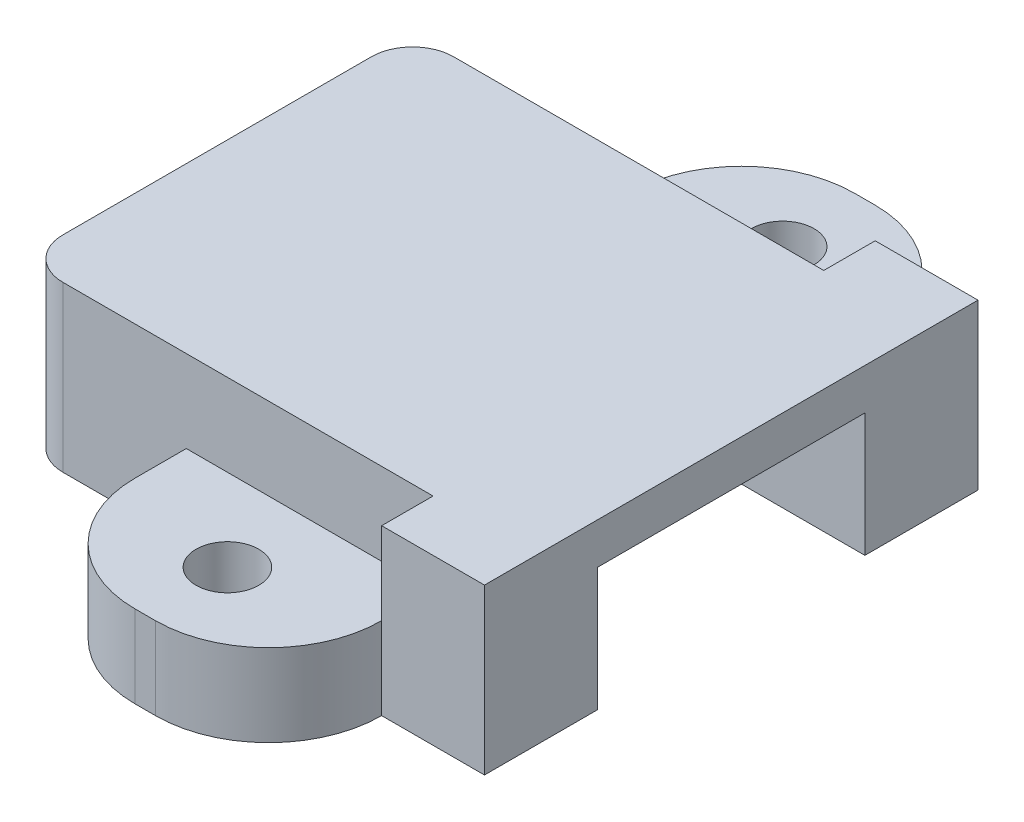
ISO-10303-21;
HEADER;
FILE_DESCRIPTION(('STEP AP214'),'2;1');
FILE_NAME('part.step','',(''),(''),'','','');
FILE_SCHEMA(('AUTOMOTIVE_DESIGN { 1 0 10303 214 1 1 1 1 }'));
ENDSEC;
DATA;
#1=APPLICATION_CONTEXT('core data for automotive mechanical design processes');
#2=APPLICATION_PROTOCOL_DEFINITION('international standard','automotive_design',2000,#1);
#3=PRODUCT_CONTEXT('',#1,'mechanical');
#4=PRODUCT('Part','Part','',(#3));
#5=PRODUCT_RELATED_PRODUCT_CATEGORY('part','',(#4));
#6=PRODUCT_DEFINITION_FORMATION('','',#4);
#7=PRODUCT_DEFINITION_CONTEXT('part definition',#1,'design');
#8=PRODUCT_DEFINITION('design','',#6,#7);
#9=PRODUCT_DEFINITION_SHAPE('','',#8);
#10=(LENGTH_UNIT() NAMED_UNIT(*) SI_UNIT(.MILLI.,.METRE.));
#11=(NAMED_UNIT(*) PLANE_ANGLE_UNIT() SI_UNIT($,.RADIAN.));
#12=(NAMED_UNIT(*) SI_UNIT($,.STERADIAN.) SOLID_ANGLE_UNIT());
#13=UNCERTAINTY_MEASURE_WITH_UNIT(LENGTH_MEASURE(1.E-05),#10,'distance_accuracy_value','');
#14=(GEOMETRIC_REPRESENTATION_CONTEXT(3) GLOBAL_UNCERTAINTY_ASSIGNED_CONTEXT((#13)) GLOBAL_UNIT_ASSIGNED_CONTEXT((#10,
#11,#12)) REPRESENTATION_CONTEXT('',''));
#15=CARTESIAN_POINT('',(0.,0.,0.));
#16=DIRECTION('',(0.,0.,1.));
#17=DIRECTION('',(1.,0.,0.));
#18=AXIS2_PLACEMENT_3D('',#15,#16,#17);
#19=CARTESIAN_POINT('',(-0.999999999999986,6.,-16.));
#20=DIRECTION('',(0.,0.,1.));
#21=DIRECTION('',(1.,0.,0.));
#22=AXIS2_PLACEMENT_3D('',#19,#20,#21);
#23=PLANE('',#22);
#24=DIRECTION('',(-1.,0.,0.));
#25=VECTOR('',#24,1.);
#26=CARTESIAN_POINT('',(23.,8.,-16.));
#27=LINE('',#26,#25);
#28=CARTESIAN_POINT('',(17.,8.,-16.));
#29=VERTEX_POINT('',#28);
#30=CARTESIAN_POINT('',(-0.999999999999987,8.,-16.));
#31=VERTEX_POINT('',#30);
#32=EDGE_CURVE('E411',#29,#31,#27,.T.);
#33=ORIENTED_EDGE('',*,*,#32,.F.);
#34=DIRECTION('',(0.,1.,0.));
#35=VECTOR('',#34,1.);
#36=CARTESIAN_POINT('',(17.,-5.59016994374948,-16.));
#37=LINE('',#36,#35);
#38=CARTESIAN_POINT('',(17.,4.,-16.));
#39=VERTEX_POINT('',#38);
#40=EDGE_CURVE('E467',#39,#29,#37,.T.);
#41=ORIENTED_EDGE('',*,*,#40,.F.);
#42=DIRECTION('',(1.,0.,0.));
#43=VECTOR('',#42,1.);
#44=CARTESIAN_POINT('',(17.,4.,-16.));
#45=LINE('',#44,#43);
#46=CARTESIAN_POINT('',(5.,4.,-16.));
#47=VERTEX_POINT('',#46);
#48=EDGE_CURVE('E329',#47,#39,#45,.T.);
#49=ORIENTED_EDGE('',*,*,#48,.F.);
#50=DIRECTION('',(0.,-1.,0.));
#51=VECTOR('',#50,1.);
#52=CARTESIAN_POINT('',(5.,22.422205101856,-16.));
#53=LINE('',#52,#51);
#54=CARTESIAN_POINT('',(5.,0.,-16.));
#55=VERTEX_POINT('',#54);
#56=EDGE_CURVE('E385',#47,#55,#53,.T.);
#57=ORIENTED_EDGE('',*,*,#56,.T.);
#58=DIRECTION('',(-1.,0.,0.));
#59=VECTOR('',#58,1.);
#60=CARTESIAN_POINT('',(-0.999999999999986,0.,-16.));
#61=LINE('',#60,#59);
#62=CARTESIAN_POINT('',(-0.999999999999986,0.,-16.));
#63=VERTEX_POINT('',#62);
#64=EDGE_CURVE('E290',#55,#63,#61,.T.);
#65=ORIENTED_EDGE('',*,*,#64,.T.);
#66=DIRECTION('',(0.,-1.,0.));
#67=VECTOR('',#66,1.);
#68=CARTESIAN_POINT('',(-0.999999999999986,6.,-16.));
#69=LINE('',#68,#67);
#70=EDGE_CURVE('E311',#31,#63,#69,.T.);
#71=ORIENTED_EDGE('',*,*,#70,.F.);
#72=EDGE_LOOP('',(#33,#41,#49,#57,#65,#71));
#73=FACE_BOUND('',#72,.T.);
#74=ADVANCED_FACE('F33',(#73),#23,.F.);
#75=CARTESIAN_POINT('',(5.,22.422205101856,3.));
#76=DIRECTION('',(-1.,0.,0.));
#77=DIRECTION('',(0.,0.,1.));
#78=AXIS2_PLACEMENT_3D('',#75,#76,#77);
#79=PLANE('',#78);
#80=DIRECTION('',(0.,-1.,0.));
#81=VECTOR('',#80,1.);
#82=CARTESIAN_POINT('',(5.,22.422205101856,5.5));
#83=LINE('',#82,#81);
#84=CARTESIAN_POINT('',(5.,4.,5.5));
#85=VERTEX_POINT('',#84);
#86=CARTESIAN_POINT('',(5.,0.,5.5));
#87=VERTEX_POINT('',#86);
#88=EDGE_CURVE('E409',#85,#87,#83,.T.);
#89=ORIENTED_EDGE('',*,*,#88,.F.);
#90=DIRECTION('',(0.,0.,-1.));
#91=VECTOR('',#90,1.);
#92=CARTESIAN_POINT('',(5.,4.,3.));
#93=LINE('',#92,#91);
#94=CARTESIAN_POINT('',(5.,4.,3.));
#95=VERTEX_POINT('',#94);
#96=EDGE_CURVE('E440',#85,#95,#93,.T.);
#97=ORIENTED_EDGE('',*,*,#96,.T.);
#98=DIRECTION('',(0.,-1.,0.));
#99=VECTOR('',#98,1.);
#100=CARTESIAN_POINT('',(5.,22.422205101856,3.));
#101=LINE('',#100,#99);
#102=CARTESIAN_POINT('',(5.,0.,3.));
#103=VERTEX_POINT('',#102);
#104=EDGE_CURVE('E408',#95,#103,#101,.T.);
#105=ORIENTED_EDGE('',*,*,#104,.T.);
#106=DIRECTION('',(0.,0.,-1.));
#107=VECTOR('',#106,1.);
#108=CARTESIAN_POINT('',(5.,0.,3.));
#109=LINE('',#108,#107);
#110=EDGE_CURVE('E389',#87,#103,#109,.T.);
#111=ORIENTED_EDGE('',*,*,#110,.F.);
#112=EDGE_LOOP('',(#89,#97,#105,#111));
#113=FACE_BOUND('',#112,.T.);
#114=ADVANCED_FACE('F438',(#113),#79,.T.);
#115=CARTESIAN_POINT('',(10.5,22.422205101856,5.5));
#116=DIRECTION('',(0.,-1.,0.));
#117=DIRECTION('',(0.,0.,-1.));
#118=AXIS2_PLACEMENT_3D('',#115,#116,#117);
#119=CYLINDRICAL_SURFACE('',#118,5.5);
#120=DIRECTION('',(0.,-1.,0.));
#121=VECTOR('',#120,1.);
#122=CARTESIAN_POINT('',(10.5,22.422205101856,11.));
#123=LINE('',#122,#121);
#124=CARTESIAN_POINT('',(10.5,4.,11.));
#125=VERTEX_POINT('',#124);
#126=CARTESIAN_POINT('',(10.5,0.,11.));
#127=VERTEX_POINT('',#126);
#128=EDGE_CURVE('E412',#125,#127,#123,.T.);
#129=ORIENTED_EDGE('',*,*,#128,.F.);
#130=CARTESIAN_POINT('',(10.5,4.,5.5));
#131=DIRECTION('',(0.,1.,0.));
#132=DIRECTION('',(0.,0.,1.));
#133=AXIS2_PLACEMENT_3D('',#130,#131,#132);
#134=CIRCLE('',#133,5.5);
#135=EDGE_CURVE('E443',#125,#85,#134,.F.);
#136=ORIENTED_EDGE('',*,*,#135,.T.);
#137=ORIENTED_EDGE('',*,*,#88,.T.);
#138=CARTESIAN_POINT('',(10.5,0.,5.5));
#139=DIRECTION('',(0.,-1.,0.));
#140=DIRECTION('',(0.,0.,1.));
#141=AXIS2_PLACEMENT_3D('',#138,#139,#140);
#142=CIRCLE('',#141,5.5);
#143=EDGE_CURVE('E405',#127,#87,#142,.T.);
#144=ORIENTED_EDGE('',*,*,#143,.F.);
#145=EDGE_LOOP('',(#129,#136,#137,#144));
#146=FACE_BOUND('',#145,.T.);
#147=ADVANCED_FACE('F561',(#146),#119,.T.);
#148=CARTESIAN_POINT('',(10.5,22.422205101856,11.));
#149=DIRECTION('',(0.,0.,1.));
#150=DIRECTION('',(1.,0.,0.));
#151=AXIS2_PLACEMENT_3D('',#148,#149,#150);
#152=PLANE('',#151);
#153=DIRECTION('',(0.,-1.,0.));
#154=VECTOR('',#153,1.);
#155=CARTESIAN_POINT('',(11.5,22.422205101856,11.));
#156=LINE('',#155,#154);
#157=CARTESIAN_POINT('',(11.5,4.,11.));
#158=VERTEX_POINT('',#157);
#159=CARTESIAN_POINT('',(11.5,0.,11.));
#160=VERTEX_POINT('',#159);
#161=EDGE_CURVE('E414',#158,#160,#156,.T.);
#162=ORIENTED_EDGE('',*,*,#161,.F.);
#163=DIRECTION('',(-1.,0.,0.));
#164=VECTOR('',#163,1.);
#165=CARTESIAN_POINT('',(10.5,4.,11.));
#166=LINE('',#165,#164);
#167=EDGE_CURVE('E445',#158,#125,#166,.T.);
#168=ORIENTED_EDGE('',*,*,#167,.T.);
#169=ORIENTED_EDGE('',*,*,#128,.T.);
#170=DIRECTION('',(-1.,0.,0.));
#171=VECTOR('',#170,1.);
#172=CARTESIAN_POINT('',(10.5,0.,11.));
#173=LINE('',#172,#171);
#174=EDGE_CURVE('E402',#160,#127,#173,.T.);
#175=ORIENTED_EDGE('',*,*,#174,.F.);
#176=EDGE_LOOP('',(#162,#168,#169,#175));
#177=FACE_BOUND('',#176,.T.);
#178=ADVANCED_FACE('F683',(#177),#152,.T.);
#179=CARTESIAN_POINT('',(11.5,22.422205101856,5.5));
#180=DIRECTION('',(0.,-1.,0.));
#181=DIRECTION('',(0.,0.,-1.));
#182=AXIS2_PLACEMENT_3D('',#179,#180,#181);
#183=CYLINDRICAL_SURFACE('',#182,5.5);
#184=DIRECTION('',(0.,-1.,0.));
#185=VECTOR('',#184,1.);
#186=CARTESIAN_POINT('',(17.,22.422205101856,5.5));
#187=LINE('',#186,#185);
#188=CARTESIAN_POINT('',(17.,4.,5.5));
#189=VERTEX_POINT('',#188);
#190=CARTESIAN_POINT('',(17.,0.,5.5));
#191=VERTEX_POINT('',#190);
#192=EDGE_CURVE('E416',#189,#191,#187,.T.);
#193=ORIENTED_EDGE('',*,*,#192,.F.);
#194=CARTESIAN_POINT('',(11.5,4.,5.5));
#195=DIRECTION('',(0.,1.,0.));
#196=DIRECTION('',(0.,0.,1.));
#197=AXIS2_PLACEMENT_3D('',#194,#195,#196);
#198=CIRCLE('',#197,5.5);
#199=EDGE_CURVE('E450',#189,#158,#198,.F.);
#200=ORIENTED_EDGE('',*,*,#199,.T.);
#201=ORIENTED_EDGE('',*,*,#161,.T.);
#202=CARTESIAN_POINT('',(11.5,0.,5.5));
#203=DIRECTION('',(0.,-1.,0.));
#204=DIRECTION('',(0.,0.,1.));
#205=AXIS2_PLACEMENT_3D('',#202,#203,#204);
#206=CIRCLE('',#205,5.5);
#207=EDGE_CURVE('E399',#191,#160,#206,.T.);
#208=ORIENTED_EDGE('',*,*,#207,.F.);
#209=EDGE_LOOP('',(#193,#200,#201,#208));
#210=FACE_BOUND('',#209,.T.);
#211=ADVANCED_FACE('F679',(#210),#183,.T.);
#212=CARTESIAN_POINT('',(11.,8.,7.));
#213=DIRECTION('',(0.,-1.,0.));
#214=DIRECTION('',(0.,0.,-1.));
#215=AXIS2_PLACEMENT_3D('',#212,#213,#214);
#216=CYLINDRICAL_SURFACE('',#215,1.524);
#217=CARTESIAN_POINT('',(11.,0.,7.));
#218=DIRECTION('',(0.,-1.,0.));
#219=DIRECTION('',(0.,0.,-1.));
#220=AXIS2_PLACEMENT_3D('',#217,#218,#219);
#221=CIRCLE('',#220,1.524);
#222=CARTESIAN_POINT('',(11.,0.,5.476));
#223=VERTEX_POINT('',#222);
#224=EDGE_CURVE('E367',#223,#223,#221,.T.);
#225=ORIENTED_EDGE('',*,*,#224,.T.);
#226=EDGE_LOOP('',(#225));
#227=FACE_BOUND('',#226,.T.);
#228=CARTESIAN_POINT('',(11.,4.,7.));
#229=DIRECTION('',(0.,1.,0.));
#230=DIRECTION('',(0.,0.,1.));
#231=AXIS2_PLACEMENT_3D('',#228,#229,#230);
#232=CIRCLE('',#231,1.524);
#233=CARTESIAN_POINT('',(11.,4.,8.524));
#234=VERTEX_POINT('',#233);
#235=EDGE_CURVE('E37',#234,#234,#232,.F.);
#236=ORIENTED_EDGE('',*,*,#235,.F.);
#237=EDGE_LOOP('',(#236));
#238=FACE_BOUND('',#237,.T.);
#239=ADVANCED_FACE('F669',(#227,#238),#216,.F.);
#240=CARTESIAN_POINT('',(11.5,22.422205101856,-18.5));
#241=DIRECTION('',(0.,-1.,0.));
#242=DIRECTION('',(0.,0.,-1.));
#243=AXIS2_PLACEMENT_3D('',#240,#241,#242);
#244=CYLINDRICAL_SURFACE('',#243,5.5);
#245=DIRECTION('',(0.,-1.,0.));
#246=VECTOR('',#245,1.);
#247=CARTESIAN_POINT('',(11.5,22.422205101856,-24.));
#248=LINE('',#247,#246);
#249=CARTESIAN_POINT('',(11.5,4.,-24.));
#250=VERTEX_POINT('',#249);
#251=CARTESIAN_POINT('',(11.5,0.,-24.));
#252=VERTEX_POINT('',#251);
#253=EDGE_CURVE('E390',#250,#252,#248,.T.);
#254=ORIENTED_EDGE('',*,*,#253,.F.);
#255=CARTESIAN_POINT('',(11.5,4.,-18.5));
#256=DIRECTION('',(0.,1.,0.));
#257=DIRECTION('',(0.,0.,1.));
#258=AXIS2_PLACEMENT_3D('',#255,#256,#257);
#259=CIRCLE('',#258,5.5);
#260=CARTESIAN_POINT('',(17.,4.,-18.5));
#261=VERTEX_POINT('',#260);
#262=EDGE_CURVE('E345',#250,#261,#259,.F.);
#263=ORIENTED_EDGE('',*,*,#262,.T.);
#264=DIRECTION('',(0.,-1.,0.));
#265=VECTOR('',#264,1.);
#266=CARTESIAN_POINT('',(17.,22.422205101856,-18.5));
#267=LINE('',#266,#265);
#268=CARTESIAN_POINT('',(17.,0.,-18.5));
#269=VERTEX_POINT('',#268);
#270=EDGE_CURVE('E386',#261,#269,#267,.T.);
#271=ORIENTED_EDGE('',*,*,#270,.T.);
#272=CARTESIAN_POINT('',(11.5,0.,-18.5));
#273=DIRECTION('',(0.,-1.,0.));
#274=DIRECTION('',(0.,0.,1.));
#275=AXIS2_PLACEMENT_3D('',#272,#273,#274);
#276=CIRCLE('',#275,5.5);
#277=EDGE_CURVE('E382',#252,#269,#276,.T.);
#278=ORIENTED_EDGE('',*,*,#277,.F.);
#279=EDGE_LOOP('',(#254,#263,#271,#278));
#280=FACE_BOUND('',#279,.T.);
#281=ADVANCED_FACE('F663',(#280),#244,.T.);
#282=CARTESIAN_POINT('',(11.5,22.422205101856,-24.));
#283=DIRECTION('',(0.,0.,-1.));
#284=DIRECTION('',(-1.,0.,0.));
#285=AXIS2_PLACEMENT_3D('',#282,#283,#284);
#286=PLANE('',#285);
#287=DIRECTION('',(0.,-1.,0.));
#288=VECTOR('',#287,1.);
#289=CARTESIAN_POINT('',(10.5,22.422205101856,-24.));
#290=LINE('',#289,#288);
#291=CARTESIAN_POINT('',(10.5,4.,-24.));
#292=VERTEX_POINT('',#291);
#293=CARTESIAN_POINT('',(10.5,0.,-24.));
#294=VERTEX_POINT('',#293);
#295=EDGE_CURVE('E392',#292,#294,#290,.T.);
#296=ORIENTED_EDGE('',*,*,#295,.F.);
#297=DIRECTION('',(1.,0.,0.));
#298=VECTOR('',#297,1.);
#299=CARTESIAN_POINT('',(11.5,4.,-24.));
#300=LINE('',#299,#298);
#301=EDGE_CURVE('E332',#292,#250,#300,.T.);
#302=ORIENTED_EDGE('',*,*,#301,.T.);
#303=ORIENTED_EDGE('',*,*,#253,.T.);
#304=DIRECTION('',(1.,0.,0.));
#305=VECTOR('',#304,1.);
#306=CARTESIAN_POINT('',(11.5,0.,-24.));
#307=LINE('',#306,#305);
#308=EDGE_CURVE('E379',#294,#252,#307,.T.);
#309=ORIENTED_EDGE('',*,*,#308,.F.);
#310=EDGE_LOOP('',(#296,#302,#303,#309));
#311=FACE_BOUND('',#310,.T.);
#312=ADVANCED_FACE('F668',(#311),#286,.T.);
#313=CARTESIAN_POINT('',(10.5,22.422205101856,-18.5));
#314=DIRECTION('',(0.,-1.,0.));
#315=DIRECTION('',(0.,0.,-1.));
#316=AXIS2_PLACEMENT_3D('',#313,#314,#315);
#317=CYLINDRICAL_SURFACE('',#316,5.5);
#318=DIRECTION('',(0.,-1.,0.));
#319=VECTOR('',#318,1.);
#320=CARTESIAN_POINT('',(5.,22.422205101856,-18.5));
#321=LINE('',#320,#319);
#322=CARTESIAN_POINT('',(5.,4.,-18.5));
#323=VERTEX_POINT('',#322);
#324=CARTESIAN_POINT('',(5.,0.,-18.5));
#325=VERTEX_POINT('',#324);
#326=EDGE_CURVE('E394',#323,#325,#321,.T.);
#327=ORIENTED_EDGE('',*,*,#326,.F.);
#328=CARTESIAN_POINT('',(10.5,4.,-18.5));
#329=DIRECTION('',(0.,1.,0.));
#330=DIRECTION('',(0.,0.,1.));
#331=AXIS2_PLACEMENT_3D('',#328,#329,#330);
#332=CIRCLE('',#331,5.5);
#333=EDGE_CURVE('E50',#323,#292,#332,.F.);
#334=ORIENTED_EDGE('',*,*,#333,.T.);
#335=ORIENTED_EDGE('',*,*,#295,.T.);
#336=CARTESIAN_POINT('',(10.5,0.,-18.5));
#337=DIRECTION('',(0.,-1.,0.));
#338=DIRECTION('',(0.,0.,1.));
#339=AXIS2_PLACEMENT_3D('',#336,#337,#338);
#340=CIRCLE('',#339,5.5);
#341=EDGE_CURVE('E376',#325,#294,#340,.T.);
#342=ORIENTED_EDGE('',*,*,#341,.F.);
#343=EDGE_LOOP('',(#327,#334,#335,#342));
#344=FACE_BOUND('',#343,.T.);
#345=ADVANCED_FACE('F737',(#344),#317,.T.);
#346=CARTESIAN_POINT('',(5.,22.422205101856,-16.));
#347=DIRECTION('',(-1.,0.,0.));
#348=DIRECTION('',(0.,0.,1.));
#349=AXIS2_PLACEMENT_3D('',#346,#347,#348);
#350=PLANE('',#349);
#351=ORIENTED_EDGE('',*,*,#56,.F.);
#352=DIRECTION('',(0.,0.,1.));
#353=VECTOR('',#352,1.);
#354=CARTESIAN_POINT('',(5.,4.,-16.));
#355=LINE('',#354,#353);
#356=EDGE_CURVE('E335',#323,#47,#355,.T.);
#357=ORIENTED_EDGE('',*,*,#356,.F.);
#358=ORIENTED_EDGE('',*,*,#326,.T.);
#359=DIRECTION('',(0.,0.,-1.));
#360=VECTOR('',#359,1.);
#361=CARTESIAN_POINT('',(5.,0.,-16.));
#362=LINE('',#361,#360);
#363=EDGE_CURVE('E373',#55,#325,#362,.T.);
#364=ORIENTED_EDGE('',*,*,#363,.F.);
#365=EDGE_LOOP('',(#351,#357,#358,#364));
#366=FACE_BOUND('',#365,.T.);
#367=ADVANCED_FACE('F726',(#366),#350,.T.);
#368=CARTESIAN_POINT('',(11.,8.,-20.));
#369=DIRECTION('',(0.,-1.,0.));
#370=DIRECTION('',(0.,0.,-1.));
#371=AXIS2_PLACEMENT_3D('',#368,#369,#370);
#372=CYLINDRICAL_SURFACE('',#371,1.525);
#373=CARTESIAN_POINT('',(11.,0.,-20.));
#374=DIRECTION('',(0.,-1.,0.));
#375=DIRECTION('',(0.,0.,-1.));
#376=AXIS2_PLACEMENT_3D('',#373,#374,#375);
#377=CIRCLE('',#376,1.525);
#378=CARTESIAN_POINT('',(11.,0.,-21.525));
#379=VERTEX_POINT('',#378);
#380=EDGE_CURVE('E370',#379,#379,#377,.T.);
#381=ORIENTED_EDGE('',*,*,#380,.T.);
#382=EDGE_LOOP('',(#381));
#383=FACE_BOUND('',#382,.T.);
#384=CARTESIAN_POINT('',(11.,4.,-20.));
#385=DIRECTION('',(0.,1.,0.));
#386=DIRECTION('',(0.,0.,1.));
#387=AXIS2_PLACEMENT_3D('',#384,#385,#386);
#388=CIRCLE('',#387,1.525);
#389=CARTESIAN_POINT('',(11.,4.,-18.475));
#390=VERTEX_POINT('',#389);
#391=EDGE_CURVE('E327',#390,#390,#388,.F.);
#392=ORIENTED_EDGE('',*,*,#391,.F.);
#393=EDGE_LOOP('',(#392));
#394=FACE_BOUND('',#393,.T.);
#395=ADVANCED_FACE('F657',(#383,#394),#372,.F.);
#396=CARTESIAN_POINT('',(-1.,0.,1.));
#397=DIRECTION('',(0.,-1.,0.));
#398=DIRECTION('',(0.,0.,-1.));
#399=AXIS2_PLACEMENT_3D('',#396,#397,#398);
#400=PLANE('',#399);
#401=DIRECTION('',(-1.,0.,0.));
#402=VECTOR('',#401,1.);
#403=CARTESIAN_POINT('',(17.,0.,-18.5));
#404=LINE('',#403,#402);
#405=CARTESIAN_POINT('',(22.,0.,-18.5));
#406=VERTEX_POINT('',#405);
#407=EDGE_CURVE('E471',#406,#269,#404,.T.);
#408=ORIENTED_EDGE('',*,*,#407,.F.);
#409=DIRECTION('',(0.,0.,-1.));
#410=VECTOR('',#409,1.);
#411=CARTESIAN_POINT('',(22.,0.,-18.5));
#412=LINE('',#411,#410);
#413=CARTESIAN_POINT('',(22.,0.,-13.));
#414=VERTEX_POINT('',#413);
#415=EDGE_CURVE('E464',#414,#406,#412,.T.);
#416=ORIENTED_EDGE('',*,*,#415,.F.);
#417=DIRECTION('',(-1.,0.,0.));
#418=VECTOR('',#417,1.);
#419=CARTESIAN_POINT('',(0.,0.,-13.));
#420=LINE('',#419,#418);
#421=CARTESIAN_POINT('',(0.,0.,-13.));
#422=VERTEX_POINT('',#421);
#423=EDGE_CURVE('E265',#414,#422,#420,.T.);
#424=ORIENTED_EDGE('',*,*,#423,.T.);
#425=DIRECTION('',(0.,0.,1.));
#426=VECTOR('',#425,1.);
#427=CARTESIAN_POINT('',(0.,0.,0.));
#428=LINE('',#427,#426);
#429=CARTESIAN_POINT('',(0.,0.,-11.));
#430=VERTEX_POINT('',#429);
#431=EDGE_CURVE('E255',#422,#430,#428,.T.);
#432=ORIENTED_EDGE('',*,*,#431,.T.);
#433=DIRECTION('',(1.,0.,0.));
#434=VECTOR('',#433,1.);
#435=CARTESIAN_POINT('',(-3.,0.,-11.));
#436=LINE('',#435,#434);
#437=CARTESIAN_POINT('',(-3.,0.,-11.));
#438=VERTEX_POINT('',#437);
#439=EDGE_CURVE('E356',#438,#430,#436,.T.);
#440=ORIENTED_EDGE('',*,*,#439,.F.);
#441=DIRECTION('',(0.,0.,1.));
#442=VECTOR('',#441,1.);
#443=CARTESIAN_POINT('',(-3.,0.,0.999999999999986));
#444=LINE('',#443,#442);
#445=CARTESIAN_POINT('',(-3.,0.,-14.));
#446=VERTEX_POINT('',#445);
#447=EDGE_CURVE('E295',#446,#438,#444,.T.);
#448=ORIENTED_EDGE('',*,*,#447,.F.);
#449=CARTESIAN_POINT('',(-1.,0.,-14.));
#450=DIRECTION('',(0.,1.,0.));
#451=DIRECTION('',(0.,0.,1.));
#452=AXIS2_PLACEMENT_3D('',#449,#450,#451);
#453=CIRCLE('',#452,2.);
#454=EDGE_CURVE('E292',#63,#446,#453,.T.);
#455=ORIENTED_EDGE('',*,*,#454,.F.);
#456=ORIENTED_EDGE('',*,*,#64,.F.);
#457=ORIENTED_EDGE('',*,*,#363,.T.);
#458=ORIENTED_EDGE('',*,*,#341,.T.);
#459=ORIENTED_EDGE('',*,*,#308,.T.);
#460=ORIENTED_EDGE('',*,*,#277,.T.);
#461=EDGE_LOOP('',(#408,#416,#424,#432,#440,#448,#455,#456,#457,#458,#459,#460));
#462=FACE_BOUND('',#461,.T.);
#463=ORIENTED_EDGE('',*,*,#380,.F.);
#464=EDGE_LOOP('',(#463));
#465=FACE_BOUND('',#464,.T.);
#466=ADVANCED_FACE('F510',(#462,#465),#400,.T.);
#467=DIRECTION('',(1.,0.,0.));
#468=VECTOR('',#467,1.);
#469=CARTESIAN_POINT('',(0.,0.,0.));
#470=LINE('',#469,#468);
#471=CARTESIAN_POINT('',(0.,0.,0.));
#472=VERTEX_POINT('',#471);
#473=CARTESIAN_POINT('',(22.,0.,0.));
#474=VERTEX_POINT('',#473);
#475=EDGE_CURVE('E275',#472,#474,#470,.T.);
#476=ORIENTED_EDGE('',*,*,#475,.T.);
#477=CARTESIAN_POINT('',(22.,0.,5.5));
#478=VERTEX_POINT('',#477);
#479=EDGE_CURVE('E462',#478,#474,#412,.T.);
#480=ORIENTED_EDGE('',*,*,#479,.F.);
#481=DIRECTION('',(1.,0.,0.));
#482=VECTOR('',#481,1.);
#483=CARTESIAN_POINT('',(17.,0.,5.5));
#484=LINE('',#483,#482);
#485=EDGE_CURVE('E246',#191,#478,#484,.T.);
#486=ORIENTED_EDGE('',*,*,#485,.F.);
#487=ORIENTED_EDGE('',*,*,#207,.T.);
#488=ORIENTED_EDGE('',*,*,#174,.T.);
#489=ORIENTED_EDGE('',*,*,#143,.T.);
#490=ORIENTED_EDGE('',*,*,#110,.T.);
#491=DIRECTION('',(1.,0.,0.));
#492=VECTOR('',#491,1.);
#493=CARTESIAN_POINT('',(-0.999999999999987,0.,3.));
#494=LINE('',#493,#492);
#495=CARTESIAN_POINT('',(-0.999999999999987,0.,3.));
#496=VERTEX_POINT('',#495);
#497=EDGE_CURVE('E300',#496,#103,#494,.T.);
#498=ORIENTED_EDGE('',*,*,#497,.F.);
#499=CARTESIAN_POINT('',(-1.,0.,1.));
#500=DIRECTION('',(0.,1.,0.));
#501=DIRECTION('',(0.,0.,-1.));
#502=AXIS2_PLACEMENT_3D('',#499,#500,#501);
#503=CIRCLE('',#502,2.);
#504=CARTESIAN_POINT('',(-3.,0.,0.999999999999987));
#505=VERTEX_POINT('',#504);
#506=EDGE_CURVE('E298',#505,#496,#503,.T.);
#507=ORIENTED_EDGE('',*,*,#506,.F.);
#508=CARTESIAN_POINT('',(-3.,0.,-2.));
#509=VERTEX_POINT('',#508);
#510=EDGE_CURVE('E294',#509,#505,#444,.T.);
#511=ORIENTED_EDGE('',*,*,#510,.F.);
#512=DIRECTION('',(1.,0.,0.));
#513=VECTOR('',#512,1.);
#514=CARTESIAN_POINT('',(-3.,0.,-2.));
#515=LINE('',#514,#513);
#516=CARTESIAN_POINT('',(0.,0.,-2.));
#517=VERTEX_POINT('',#516);
#518=EDGE_CURVE('E355',#509,#517,#515,.T.);
#519=ORIENTED_EDGE('',*,*,#518,.T.);
#520=EDGE_CURVE('E253',#517,#472,#428,.T.);
#521=ORIENTED_EDGE('',*,*,#520,.T.);
#522=EDGE_LOOP('',(#476,#480,#486,#487,#488,#489,#490,#498,#507,#511,#519,#521));
#523=FACE_BOUND('',#522,.T.);
#524=ORIENTED_EDGE('',*,*,#224,.F.);
#525=EDGE_LOOP('',(#524));
#526=FACE_BOUND('',#525,.T.);
#527=ADVANCED_FACE('F431',(#523,#526),#400,.T.);
#528=CARTESIAN_POINT('',(-1.,6.,-14.));
#529=DIRECTION('',(0.,-1.,0.));
#530=DIRECTION('',(0.,0.,-1.));
#531=AXIS2_PLACEMENT_3D('',#528,#529,#530);
#532=CYLINDRICAL_SURFACE('',#531,2.);
#533=ORIENTED_EDGE('',*,*,#454,.T.);
#534=DIRECTION('',(0.,-1.,0.));
#535=VECTOR('',#534,1.);
#536=CARTESIAN_POINT('',(-3.,6.,-14.));
#537=LINE('',#536,#535);
#538=CARTESIAN_POINT('',(-3.,8.,-14.));
#539=VERTEX_POINT('',#538);
#540=EDGE_CURVE('E308',#539,#446,#537,.T.);
#541=ORIENTED_EDGE('',*,*,#540,.F.);
#542=CARTESIAN_POINT('',(-0.999999999999987,8.,-14.));
#543=DIRECTION('',(0.,1.,0.));
#544=DIRECTION('',(0.,0.,-1.));
#545=AXIS2_PLACEMENT_3D('',#542,#543,#544);
#546=CIRCLE('',#545,2.00000000000001);
#547=EDGE_CURVE('E421',#31,#539,#546,.T.);
#548=ORIENTED_EDGE('',*,*,#547,.F.);
#549=ORIENTED_EDGE('',*,*,#70,.T.);
#550=EDGE_LOOP('',(#533,#541,#548,#549));
#551=FACE_BOUND('',#550,.T.);
#552=ADVANCED_FACE('F526',(#551),#532,.T.);
#553=CARTESIAN_POINT('',(-3.,6.,0.999999999999986));
#554=DIRECTION('',(1.,0.,0.));
#555=DIRECTION('',(0.,0.,-1.));
#556=AXIS2_PLACEMENT_3D('',#553,#554,#555);
#557=PLANE('',#556);
#558=ORIENTED_EDGE('',*,*,#447,.T.);
#559=DIRECTION('',(0.,1.,0.));
#560=VECTOR('',#559,1.);
#561=CARTESIAN_POINT('',(-3.,0.,-11.));
#562=LINE('',#561,#560);
#563=CARTESIAN_POINT('',(-3.,2.0886522564545,-11.));
#564=VERTEX_POINT('',#563);
#565=EDGE_CURVE('E348',#438,#564,#562,.T.);
#566=ORIENTED_EDGE('',*,*,#565,.T.);
#567=CARTESIAN_POINT('',(-3.,2.0886522564545,-9.00000000000001));
#568=DIRECTION('',(1.,0.,0.));
#569=DIRECTION('',(0.,0.,-1.));
#570=AXIS2_PLACEMENT_3D('',#567,#568,#569);
#571=CIRCLE('',#570,2.);
#572=CARTESIAN_POINT('',(-3.,4.0886522564545,-9.00000000000001));
#573=VERTEX_POINT('',#572);
#574=EDGE_CURVE('E11',#564,#573,#571,.T.);
#575=ORIENTED_EDGE('',*,*,#574,.T.);
#576=DIRECTION('',(0.,0.,1.));
#577=VECTOR('',#576,1.);
#578=CARTESIAN_POINT('',(-3.,4.0886522564545,-11.));
#579=LINE('',#578,#577);
#580=CARTESIAN_POINT('',(-3.,4.08865225645449,-4.));
#581=VERTEX_POINT('',#580);
#582=EDGE_CURVE('E350',#573,#581,#579,.T.);
#583=ORIENTED_EDGE('',*,*,#582,.T.);
#584=CARTESIAN_POINT('',(-3.,2.0886522564545,-4.));
#585=DIRECTION('',(1.,0.,0.));
#586=DIRECTION('',(0.,0.,-1.));
#587=AXIS2_PLACEMENT_3D('',#584,#585,#586);
#588=CIRCLE('',#587,2.);
#589=CARTESIAN_POINT('',(-3.,2.08865225645449,-2.));
#590=VERTEX_POINT('',#589);
#591=EDGE_CURVE('E325',#581,#590,#588,.T.);
#592=ORIENTED_EDGE('',*,*,#591,.T.);
#593=DIRECTION('',(0.,-1.,0.));
#594=VECTOR('',#593,1.);
#595=CARTESIAN_POINT('',(-3.,0.,-2.));
#596=LINE('',#595,#594);
#597=EDGE_CURVE('E353',#590,#509,#596,.T.);
#598=ORIENTED_EDGE('',*,*,#597,.T.);
#599=ORIENTED_EDGE('',*,*,#510,.T.);
#600=DIRECTION('',(0.,-1.,0.));
#601=VECTOR('',#600,1.);
#602=CARTESIAN_POINT('',(-3.,6.,0.999999999999987));
#603=LINE('',#602,#601);
#604=CARTESIAN_POINT('',(-3.,8.,0.999999999999986));
#605=VERTEX_POINT('',#604);
#606=EDGE_CURVE('E305',#605,#505,#603,.T.);
#607=ORIENTED_EDGE('',*,*,#606,.F.);
#608=DIRECTION('',(0.,0.,1.));
#609=VECTOR('',#608,1.);
#610=CARTESIAN_POINT('',(-3.,8.,0.999999999999987));
#611=LINE('',#610,#609);
#612=EDGE_CURVE('E257',#539,#605,#611,.T.);
#613=ORIENTED_EDGE('',*,*,#612,.F.);
#614=ORIENTED_EDGE('',*,*,#540,.T.);
#615=EDGE_LOOP('',(#558,#566,#575,#583,#592,#598,#599,#607,#613,#614));
#616=FACE_BOUND('',#615,.T.);
#617=ADVANCED_FACE('F528',(#616),#557,.F.);
#618=CARTESIAN_POINT('',(-1.,6.,1.));
#619=DIRECTION('',(0.,-1.,0.));
#620=DIRECTION('',(0.,0.,-1.));
#621=AXIS2_PLACEMENT_3D('',#618,#619,#620);
#622=CYLINDRICAL_SURFACE('',#621,2.);
#623=ORIENTED_EDGE('',*,*,#506,.T.);
#624=DIRECTION('',(0.,-1.,0.));
#625=VECTOR('',#624,1.);
#626=CARTESIAN_POINT('',(-0.999999999999987,6.,3.));
#627=LINE('',#626,#625);
#628=CARTESIAN_POINT('',(-0.999999999999979,8.,3.));
#629=VERTEX_POINT('',#628);
#630=EDGE_CURVE('E303',#629,#496,#627,.T.);
#631=ORIENTED_EDGE('',*,*,#630,.F.);
#632=CARTESIAN_POINT('',(-0.999999999999979,8.,0.999999999999979));
#633=DIRECTION('',(0.,1.,0.));
#634=DIRECTION('',(0.,0.,-1.));
#635=AXIS2_PLACEMENT_3D('',#632,#633,#634);
#636=CIRCLE('',#635,2.00000000000002);
#637=EDGE_CURVE('E252',#605,#629,#636,.T.);
#638=ORIENTED_EDGE('',*,*,#637,.F.);
#639=ORIENTED_EDGE('',*,*,#606,.T.);
#640=EDGE_LOOP('',(#623,#631,#638,#639));
#641=FACE_BOUND('',#640,.T.);
#642=ADVANCED_FACE('F427',(#641),#622,.T.);
#643=CARTESIAN_POINT('',(-0.999999999999987,6.,3.));
#644=DIRECTION('',(0.,0.,-1.));
#645=DIRECTION('',(-1.,0.,0.));
#646=AXIS2_PLACEMENT_3D('',#643,#644,#645);
#647=PLANE('',#646);
#648=DIRECTION('',(-1.,0.,0.));
#649=VECTOR('',#648,1.);
#650=CARTESIAN_POINT('',(19.0682094438694,4.,3.));
#651=LINE('',#650,#649);
#652=CARTESIAN_POINT('',(17.,4.,3.));
#653=VERTEX_POINT('',#652);
#654=EDGE_CURVE('E245',#653,#95,#651,.T.);
#655=ORIENTED_EDGE('',*,*,#654,.F.);
#656=DIRECTION('',(0.,1.,0.));
#657=VECTOR('',#656,1.);
#658=CARTESIAN_POINT('',(17.,-5.59016994374948,3.));
#659=LINE('',#658,#657);
#660=CARTESIAN_POINT('',(17.,8.,3.));
#661=VERTEX_POINT('',#660);
#662=EDGE_CURVE('E228',#653,#661,#659,.T.);
#663=ORIENTED_EDGE('',*,*,#662,.T.);
#664=DIRECTION('',(1.,0.,0.));
#665=VECTOR('',#664,1.);
#666=CARTESIAN_POINT('',(23.,8.,3.));
#667=LINE('',#666,#665);
#668=EDGE_CURVE('E243',#629,#661,#667,.T.);
#669=ORIENTED_EDGE('',*,*,#668,.F.);
#670=ORIENTED_EDGE('',*,*,#630,.T.);
#671=ORIENTED_EDGE('',*,*,#497,.T.);
#672=ORIENTED_EDGE('',*,*,#104,.F.);
#673=EDGE_LOOP('',(#655,#663,#669,#670,#671,#672));
#674=FACE_BOUND('',#673,.T.);
#675=ADVANCED_FACE('F241',(#674),#647,.F.);
#676=CARTESIAN_POINT('',(0.,6.,0.));
#677=DIRECTION('',(1.,0.,0.));
#678=DIRECTION('',(0.,0.,-1.));
#679=AXIS2_PLACEMENT_3D('',#676,#677,#678);
#680=PLANE('',#679);
#681=DIRECTION('',(0.,1.,0.));
#682=VECTOR('',#681,1.);
#683=CARTESIAN_POINT('',(0.,6.,-11.));
#684=LINE('',#683,#682);
#685=CARTESIAN_POINT('',(0.,2.0886522564545,-11.));
#686=VERTEX_POINT('',#685);
#687=EDGE_CURVE('E365',#430,#686,#684,.T.);
#688=ORIENTED_EDGE('',*,*,#687,.F.);
#689=ORIENTED_EDGE('',*,*,#431,.F.);
#690=DIRECTION('',(0.,-1.,0.));
#691=VECTOR('',#690,1.);
#692=CARTESIAN_POINT('',(0.,6.,-13.));
#693=LINE('',#692,#691);
#694=CARTESIAN_POINT('',(0.,6.,-13.));
#695=VERTEX_POINT('',#694);
#696=EDGE_CURVE('E272',#695,#422,#693,.T.);
#697=ORIENTED_EDGE('',*,*,#696,.F.);
#698=DIRECTION('',(0.,0.,1.));
#699=VECTOR('',#698,1.);
#700=CARTESIAN_POINT('',(0.,6.,0.));
#701=LINE('',#700,#699);
#702=CARTESIAN_POINT('',(0.,6.,0.));
#703=VERTEX_POINT('',#702);
#704=EDGE_CURVE('E261',#695,#703,#701,.T.);
#705=ORIENTED_EDGE('',*,*,#704,.T.);
#706=DIRECTION('',(0.,-1.,0.));
#707=VECTOR('',#706,1.);
#708=CARTESIAN_POINT('',(0.,6.,0.));
#709=LINE('',#708,#707);
#710=EDGE_CURVE('E287',#703,#472,#709,.T.);
#711=ORIENTED_EDGE('',*,*,#710,.T.);
#712=ORIENTED_EDGE('',*,*,#520,.F.);
#713=DIRECTION('',(0.,-1.,0.));
#714=VECTOR('',#713,1.);
#715=CARTESIAN_POINT('',(0.,6.,-2.));
#716=LINE('',#715,#714);
#717=CARTESIAN_POINT('',(0.,2.08865225645449,-2.));
#718=VERTEX_POINT('',#717);
#719=EDGE_CURVE('E363',#718,#517,#716,.T.);
#720=ORIENTED_EDGE('',*,*,#719,.F.);
#721=CARTESIAN_POINT('',(0.,2.0886522564545,-4.));
#722=DIRECTION('',(1.,0.,0.));
#723=DIRECTION('',(0.,0.,-1.));
#724=AXIS2_PLACEMENT_3D('',#721,#722,#723);
#725=CIRCLE('',#724,2.);
#726=CARTESIAN_POINT('',(0.,4.0886522564545,-4.));
#727=VERTEX_POINT('',#726);
#728=EDGE_CURVE('E323',#718,#727,#725,.F.);
#729=ORIENTED_EDGE('',*,*,#728,.T.);
#730=DIRECTION('',(0.,0.,1.));
#731=VECTOR('',#730,1.);
#732=CARTESIAN_POINT('',(0.,4.08865225645449,0.));
#733=LINE('',#732,#731);
#734=CARTESIAN_POINT('',(0.,4.0886522564545,-9.00000000000001));
#735=VERTEX_POINT('',#734);
#736=EDGE_CURVE('E358',#735,#727,#733,.T.);
#737=ORIENTED_EDGE('',*,*,#736,.F.);
#738=CARTESIAN_POINT('',(0.,2.0886522564545,-9.00000000000001));
#739=DIRECTION('',(1.,0.,0.));
#740=DIRECTION('',(0.,0.,-1.));
#741=AXIS2_PLACEMENT_3D('',#738,#739,#740);
#742=CIRCLE('',#741,2.);
#743=EDGE_CURVE('E42',#735,#686,#742,.F.);
#744=ORIENTED_EDGE('',*,*,#743,.T.);
#745=EDGE_LOOP('',(#688,#689,#697,#705,#711,#712,#720,#729,#737,#744));
#746=FACE_BOUND('',#745,.T.);
#747=ADVANCED_FACE('F496',(#746),#680,.T.);
#748=CARTESIAN_POINT('',(0.,6.,0.));
#749=DIRECTION('',(0.,0.,-1.));
#750=DIRECTION('',(-1.,0.,0.));
#751=AXIS2_PLACEMENT_3D('',#748,#749,#750);
#752=PLANE('',#751);
#753=ORIENTED_EDGE('',*,*,#475,.F.);
#754=ORIENTED_EDGE('',*,*,#710,.F.);
#755=DIRECTION('',(1.,0.,0.));
#756=VECTOR('',#755,1.);
#757=CARTESIAN_POINT('',(0.,6.,0.));
#758=LINE('',#757,#756);
#759=CARTESIAN_POINT('',(22.,6.,0.));
#760=VERTEX_POINT('',#759);
#761=EDGE_CURVE('E264',#703,#760,#758,.T.);
#762=ORIENTED_EDGE('',*,*,#761,.T.);
#763=DIRECTION('',(0.,-1.,0.));
#764=VECTOR('',#763,1.);
#765=CARTESIAN_POINT('',(22.,6.,0.));
#766=LINE('',#765,#764);
#767=EDGE_CURVE('E284',#760,#474,#766,.T.);
#768=ORIENTED_EDGE('',*,*,#767,.T.);
#769=EDGE_LOOP('',(#753,#754,#762,#768));
#770=FACE_BOUND('',#769,.T.);
#771=ADVANCED_FACE('F493',(#770),#752,.T.);
#772=CARTESIAN_POINT('',(0.,6.,-13.));
#773=DIRECTION('',(0.,0.,1.));
#774=DIRECTION('',(1.,0.,0.));
#775=AXIS2_PLACEMENT_3D('',#772,#773,#774);
#776=PLANE('',#775);
#777=ORIENTED_EDGE('',*,*,#423,.F.);
#778=DIRECTION('',(0.,-1.,0.));
#779=VECTOR('',#778,1.);
#780=CARTESIAN_POINT('',(22.,6.,-13.));
#781=LINE('',#780,#779);
#782=CARTESIAN_POINT('',(22.,6.,-13.));
#783=VERTEX_POINT('',#782);
#784=EDGE_CURVE('E282',#783,#414,#781,.T.);
#785=ORIENTED_EDGE('',*,*,#784,.F.);
#786=DIRECTION('',(-1.,0.,0.));
#787=VECTOR('',#786,1.);
#788=CARTESIAN_POINT('',(0.,6.,-13.));
#789=LINE('',#788,#787);
#790=EDGE_CURVE('E270',#783,#695,#789,.T.);
#791=ORIENTED_EDGE('',*,*,#790,.T.);
#792=ORIENTED_EDGE('',*,*,#696,.T.);
#793=EDGE_LOOP('',(#777,#785,#791,#792));
#794=FACE_BOUND('',#793,.T.);
#795=ADVANCED_FACE('F506',(#794),#776,.T.);
#796=CARTESIAN_POINT('',(-0.999999999999979,6.,0.999999999999979));
#797=DIRECTION('',(0.,-1.,0.));
#798=DIRECTION('',(0.,0.,-1.));
#799=AXIS2_PLACEMENT_3D('',#796,#797,#798);
#800=PLANE('',#799);
#801=ORIENTED_EDGE('',*,*,#761,.F.);
#802=ORIENTED_EDGE('',*,*,#704,.F.);
#803=ORIENTED_EDGE('',*,*,#790,.F.);
#804=DIRECTION('',(0.,0.,-1.));
#805=VECTOR('',#804,1.);
#806=CARTESIAN_POINT('',(22.,6.,0.));
#807=LINE('',#806,#805);
#808=EDGE_CURVE('E268',#760,#783,#807,.T.);
#809=ORIENTED_EDGE('',*,*,#808,.F.);
#810=EDGE_LOOP('',(#801,#802,#803,#809));
#811=FACE_BOUND('',#810,.T.);
#812=ADVANCED_FACE('F501',(#811),#800,.T.);
#813=CARTESIAN_POINT('',(-0.999999999999979,8.,0.999999999999979));
#814=DIRECTION('',(0.,-1.,0.));
#815=DIRECTION('',(0.,0.,-1.));
#816=AXIS2_PLACEMENT_3D('',#813,#814,#815);
#817=PLANE('',#816);
#818=ORIENTED_EDGE('',*,*,#668,.T.);
#819=DIRECTION('',(0.,0.,1.));
#820=VECTOR('',#819,1.);
#821=CARTESIAN_POINT('',(17.,8.,3.));
#822=LINE('',#821,#820);
#823=CARTESIAN_POINT('',(17.,8.,5.5));
#824=VERTEX_POINT('',#823);
#825=EDGE_CURVE('E225',#661,#824,#822,.T.);
#826=ORIENTED_EDGE('',*,*,#825,.T.);
#827=DIRECTION('',(1.,0.,0.));
#828=VECTOR('',#827,1.);
#829=CARTESIAN_POINT('',(17.,8.,5.5));
#830=LINE('',#829,#828);
#831=CARTESIAN_POINT('',(22.,8.,5.5));
#832=VERTEX_POINT('',#831);
#833=EDGE_CURVE('E236',#824,#832,#830,.T.);
#834=ORIENTED_EDGE('',*,*,#833,.T.);
#835=DIRECTION('',(0.,0.,1.));
#836=VECTOR('',#835,1.);
#837=CARTESIAN_POINT('',(22.,8.,-18.5));
#838=LINE('',#837,#836);
#839=CARTESIAN_POINT('',(22.,8.,-18.5));
#840=VERTEX_POINT('',#839);
#841=EDGE_CURVE('E465',#840,#832,#838,.T.);
#842=ORIENTED_EDGE('',*,*,#841,.F.);
#843=DIRECTION('',(-1.,0.,0.));
#844=VECTOR('',#843,1.);
#845=CARTESIAN_POINT('',(17.,8.,-18.5));
#846=LINE('',#845,#844);
#847=CARTESIAN_POINT('',(17.,8.,-18.5));
#848=VERTEX_POINT('',#847);
#849=EDGE_CURVE('E473',#840,#848,#846,.T.);
#850=ORIENTED_EDGE('',*,*,#849,.T.);
#851=DIRECTION('',(0.,0.,1.));
#852=VECTOR('',#851,1.);
#853=CARTESIAN_POINT('',(17.,8.,-16.));
#854=LINE('',#853,#852);
#855=EDGE_CURVE('E474',#848,#29,#854,.T.);
#856=ORIENTED_EDGE('',*,*,#855,.T.);
#857=ORIENTED_EDGE('',*,*,#32,.T.);
#858=ORIENTED_EDGE('',*,*,#547,.T.);
#859=ORIENTED_EDGE('',*,*,#612,.T.);
#860=ORIENTED_EDGE('',*,*,#637,.T.);
#861=EDGE_LOOP('',(#818,#826,#834,#842,#850,#856,#857,#858,#859,#860));
#862=FACE_BOUND('',#861,.T.);
#863=ADVANCED_FACE('F249',(#862),#817,.F.);
#864=CARTESIAN_POINT('',(-3.,0.,-11.));
#865=DIRECTION('',(0.,0.,-1.));
#866=DIRECTION('',(-1.,0.,0.));
#867=AXIS2_PLACEMENT_3D('',#864,#865,#866);
#868=PLANE('',#867);
#869=ORIENTED_EDGE('',*,*,#687,.T.);
#870=DIRECTION('',(1.,0.,0.));
#871=VECTOR('',#870,1.);
#872=CARTESIAN_POINT('',(-3.,2.0886522564545,-11.));
#873=LINE('',#872,#871);
#874=EDGE_CURVE('E58',#686,#564,#873,.F.);
#875=ORIENTED_EDGE('',*,*,#874,.T.);
#876=ORIENTED_EDGE('',*,*,#565,.F.);
#877=ORIENTED_EDGE('',*,*,#439,.T.);
#878=EDGE_LOOP('',(#869,#875,#876,#877));
#879=FACE_BOUND('',#878,.T.);
#880=ADVANCED_FACE('F530',(#879),#868,.F.);
#881=CARTESIAN_POINT('',(-3.,0.,-2.));
#882=DIRECTION('',(0.,0.,1.));
#883=DIRECTION('',(0.,-1.,0.));
#884=AXIS2_PLACEMENT_3D('',#881,#882,#883);
#885=PLANE('',#884);
#886=ORIENTED_EDGE('',*,*,#597,.F.);
#887=DIRECTION('',(1.,0.,0.));
#888=VECTOR('',#887,1.);
#889=CARTESIAN_POINT('',(0.,2.08865225645449,-2.));
#890=LINE('',#889,#888);
#891=EDGE_CURVE('E314',#590,#718,#890,.T.);
#892=ORIENTED_EDGE('',*,*,#891,.T.);
#893=ORIENTED_EDGE('',*,*,#719,.T.);
#894=ORIENTED_EDGE('',*,*,#518,.F.);
#895=EDGE_LOOP('',(#886,#892,#893,#894));
#896=FACE_BOUND('',#895,.T.);
#897=ADVANCED_FACE('F545',(#896),#885,.F.);
#898=CARTESIAN_POINT('',(-3.,4.0886522564545,-11.));
#899=DIRECTION('',(0.,1.,0.));
#900=DIRECTION('',(0.,0.,1.));
#901=AXIS2_PLACEMENT_3D('',#898,#899,#900);
#902=PLANE('',#901);
#903=ORIENTED_EDGE('',*,*,#736,.T.);
#904=DIRECTION('',(1.,0.,0.));
#905=VECTOR('',#904,1.);
#906=CARTESIAN_POINT('',(-3.,4.08865225645449,-4.));
#907=LINE('',#906,#905);
#908=EDGE_CURVE('E320',#727,#581,#907,.F.);
#909=ORIENTED_EDGE('',*,*,#908,.T.);
#910=ORIENTED_EDGE('',*,*,#582,.F.);
#911=DIRECTION('',(1.,0.,0.));
#912=VECTOR('',#911,1.);
#913=CARTESIAN_POINT('',(0.,4.0886522564545,-9.00000000000001));
#914=LINE('',#913,#912);
#915=EDGE_CURVE('E317',#573,#735,#914,.T.);
#916=ORIENTED_EDGE('',*,*,#915,.T.);
#917=EDGE_LOOP('',(#903,#909,#910,#916));
#918=FACE_BOUND('',#917,.T.);
#919=ADVANCED_FACE('F537',(#918),#902,.F.);
#920=CARTESIAN_POINT('',(-3.,2.0886522564545,-4.));
#921=DIRECTION('',(-1.,0.,0.));
#922=DIRECTION('',(0.,0.,1.));
#923=AXIS2_PLACEMENT_3D('',#920,#921,#922);
#924=CYLINDRICAL_SURFACE('',#923,2.);
#925=ORIENTED_EDGE('',*,*,#591,.F.);
#926=ORIENTED_EDGE('',*,*,#908,.F.);
#927=ORIENTED_EDGE('',*,*,#728,.F.);
#928=ORIENTED_EDGE('',*,*,#891,.F.);
#929=EDGE_LOOP('',(#925,#926,#927,#928));
#930=FACE_BOUND('',#929,.T.);
#931=ADVANCED_FACE('F543',(#930),#924,.F.);
#932=CARTESIAN_POINT('',(-3.,2.0886522564545,-9.00000000000001));
#933=DIRECTION('',(-1.,0.,0.));
#934=DIRECTION('',(0.,0.,1.));
#935=AXIS2_PLACEMENT_3D('',#932,#933,#934);
#936=CYLINDRICAL_SURFACE('',#935,2.);
#937=ORIENTED_EDGE('',*,*,#574,.F.);
#938=ORIENTED_EDGE('',*,*,#874,.F.);
#939=ORIENTED_EDGE('',*,*,#743,.F.);
#940=ORIENTED_EDGE('',*,*,#915,.F.);
#941=EDGE_LOOP('',(#937,#938,#939,#940));
#942=FACE_BOUND('',#941,.T.);
#943=ADVANCED_FACE('F35',(#942),#936,.F.);
#944=CARTESIAN_POINT('',(0.,4.,0.));
#945=DIRECTION('',(0.,1.,0.));
#946=DIRECTION('',(0.,0.,1.));
#947=AXIS2_PLACEMENT_3D('',#944,#945,#946);
#948=PLANE('',#947);
#949=ORIENTED_EDGE('',*,*,#301,.F.);
#950=ORIENTED_EDGE('',*,*,#333,.F.);
#951=ORIENTED_EDGE('',*,*,#356,.T.);
#952=ORIENTED_EDGE('',*,*,#48,.T.);
#953=DIRECTION('',(0.,0.,-1.));
#954=VECTOR('',#953,1.);
#955=CARTESIAN_POINT('',(17.,4.,-16.));
#956=LINE('',#955,#954);
#957=EDGE_CURVE('E339',#39,#261,#956,.T.);
#958=ORIENTED_EDGE('',*,*,#957,.T.);
#959=ORIENTED_EDGE('',*,*,#262,.F.);
#960=EDGE_LOOP('',(#949,#950,#951,#952,#958,#959));
#961=FACE_BOUND('',#960,.T.);
#962=ORIENTED_EDGE('',*,*,#391,.T.);
#963=EDGE_LOOP('',(#962));
#964=FACE_BOUND('',#963,.T.);
#965=ADVANCED_FACE('F569',(#961,#964),#948,.T.);
#966=CARTESIAN_POINT('',(0.,4.,0.));
#967=DIRECTION('',(0.,1.,0.));
#968=DIRECTION('',(0.,0.,1.));
#969=AXIS2_PLACEMENT_3D('',#966,#967,#968);
#970=PLANE('',#969);
#971=ORIENTED_EDGE('',*,*,#135,.F.);
#972=ORIENTED_EDGE('',*,*,#167,.F.);
#973=ORIENTED_EDGE('',*,*,#199,.F.);
#974=DIRECTION('',(0.,0.,1.));
#975=VECTOR('',#974,1.);
#976=CARTESIAN_POINT('',(17.,4.,3.));
#977=LINE('',#976,#975);
#978=EDGE_CURVE('E453',#653,#189,#977,.T.);
#979=ORIENTED_EDGE('',*,*,#978,.F.);
#980=ORIENTED_EDGE('',*,*,#654,.T.);
#981=ORIENTED_EDGE('',*,*,#96,.F.);
#982=EDGE_LOOP('',(#971,#972,#973,#979,#980,#981));
#983=FACE_BOUND('',#982,.T.);
#984=ORIENTED_EDGE('',*,*,#235,.T.);
#985=EDGE_LOOP('',(#984));
#986=FACE_BOUND('',#985,.T.);
#987=ADVANCED_FACE('F573',(#983,#986),#970,.T.);
#988=CARTESIAN_POINT('',(22.,0.,0.));
#989=DIRECTION('',(-1.,0.,0.));
#990=DIRECTION('',(0.,0.,1.));
#991=AXIS2_PLACEMENT_3D('',#988,#989,#990);
#992=PLANE('',#991);
#993=ORIENTED_EDGE('',*,*,#841,.T.);
#994=DIRECTION('',(0.,-1.,0.));
#995=VECTOR('',#994,1.);
#996=CARTESIAN_POINT('',(22.,8.,5.5));
#997=LINE('',#996,#995);
#998=EDGE_CURVE('E459',#832,#478,#997,.T.);
#999=ORIENTED_EDGE('',*,*,#998,.T.);
#1000=ORIENTED_EDGE('',*,*,#479,.T.);
#1001=ORIENTED_EDGE('',*,*,#767,.F.);
#1002=ORIENTED_EDGE('',*,*,#808,.T.);
#1003=ORIENTED_EDGE('',*,*,#784,.T.);
#1004=ORIENTED_EDGE('',*,*,#415,.T.);
#1005=DIRECTION('',(0.,1.,0.));
#1006=VECTOR('',#1005,1.);
#1007=CARTESIAN_POINT('',(22.,8.,-18.5));
#1008=LINE('',#1007,#1006);
#1009=EDGE_CURVE('E456',#406,#840,#1008,.T.);
#1010=ORIENTED_EDGE('',*,*,#1009,.T.);
#1011=EDGE_LOOP('',(#993,#999,#1000,#1001,#1002,#1003,#1004,#1010));
#1012=FACE_BOUND('',#1011,.T.);
#1013=ADVANCED_FACE('F488',(#1012),#992,.F.);
#1014=CARTESIAN_POINT('',(17.,-5.59016994374948,-18.5));
#1015=DIRECTION('',(0.,0.,-1.));
#1016=DIRECTION('',(-1.,0.,0.));
#1017=AXIS2_PLACEMENT_3D('',#1014,#1015,#1016);
#1018=PLANE('',#1017);
#1019=ORIENTED_EDGE('',*,*,#1009,.F.);
#1020=ORIENTED_EDGE('',*,*,#407,.T.);
#1021=ORIENTED_EDGE('',*,*,#270,.F.);
#1022=DIRECTION('',(0.,1.,0.));
#1023=VECTOR('',#1022,1.);
#1024=CARTESIAN_POINT('',(17.,-5.59016994374948,-18.5));
#1025=LINE('',#1024,#1023);
#1026=EDGE_CURVE('E469',#261,#848,#1025,.T.);
#1027=ORIENTED_EDGE('',*,*,#1026,.T.);
#1028=ORIENTED_EDGE('',*,*,#849,.F.);
#1029=EDGE_LOOP('',(#1019,#1020,#1021,#1027,#1028));
#1030=FACE_BOUND('',#1029,.T.);
#1031=ADVANCED_FACE('F516',(#1030),#1018,.T.);
#1032=CARTESIAN_POINT('',(17.,-5.59016994374948,-16.));
#1033=DIRECTION('',(-1.,0.,0.));
#1034=DIRECTION('',(0.,0.,1.));
#1035=AXIS2_PLACEMENT_3D('',#1032,#1033,#1034);
#1036=PLANE('',#1035);
#1037=ORIENTED_EDGE('',*,*,#1026,.F.);
#1038=ORIENTED_EDGE('',*,*,#957,.F.);
#1039=ORIENTED_EDGE('',*,*,#40,.T.);
#1040=ORIENTED_EDGE('',*,*,#855,.F.);
#1041=EDGE_LOOP('',(#1037,#1038,#1039,#1040));
#1042=FACE_BOUND('',#1041,.T.);
#1043=ADVANCED_FACE('F583',(#1042),#1036,.T.);
#1044=CARTESIAN_POINT('',(17.,-5.59016994374948,5.5));
#1045=DIRECTION('',(0.,0.,1.));
#1046=DIRECTION('',(1.,0.,0.));
#1047=AXIS2_PLACEMENT_3D('',#1044,#1045,#1046);
#1048=PLANE('',#1047);
#1049=ORIENTED_EDGE('',*,*,#192,.T.);
#1050=ORIENTED_EDGE('',*,*,#485,.T.);
#1051=ORIENTED_EDGE('',*,*,#998,.F.);
#1052=ORIENTED_EDGE('',*,*,#833,.F.);
#1053=DIRECTION('',(0.,1.,0.));
#1054=VECTOR('',#1053,1.);
#1055=CARTESIAN_POINT('',(17.,-5.59016994374948,5.5));
#1056=LINE('',#1055,#1054);
#1057=EDGE_CURVE('E231',#189,#824,#1056,.T.);
#1058=ORIENTED_EDGE('',*,*,#1057,.F.);
#1059=EDGE_LOOP('',(#1049,#1050,#1051,#1052,#1058));
#1060=FACE_BOUND('',#1059,.T.);
#1061=ADVANCED_FACE('F484',(#1060),#1048,.T.);
#1062=CARTESIAN_POINT('',(17.,-5.59016994374948,3.));
#1063=DIRECTION('',(-1.,0.,0.));
#1064=DIRECTION('',(0.,0.,1.));
#1065=AXIS2_PLACEMENT_3D('',#1062,#1063,#1064);
#1066=PLANE('',#1065);
#1067=ORIENTED_EDGE('',*,*,#662,.F.);
#1068=ORIENTED_EDGE('',*,*,#978,.T.);
#1069=ORIENTED_EDGE('',*,*,#1057,.T.);
#1070=ORIENTED_EDGE('',*,*,#825,.F.);
#1071=EDGE_LOOP('',(#1067,#1068,#1069,#1070));
#1072=FACE_BOUND('',#1071,.T.);
#1073=ADVANCED_FACE('F227',(#1072),#1066,.T.);
#1074=CLOSED_SHELL('',(#74,#114,#147,#178,#211,#239,#281,#312,#345,#367,#395,#466,#527,#552,
#617,#642,#675,#747,#771,#795,#812,#863,#880,#897,#919,#931,#943,#965,#987,#1013,#1031,#1043,
#1061,#1073));
#1075=MANIFOLD_SOLID_BREP('B2',#1074);
#1076=ADVANCED_BREP_SHAPE_REPRESENTATION('',(#18,#1075),#14);
#1077=SHAPE_DEFINITION_REPRESENTATION(#9,#1076);
ENDSEC;
END-ISO-10303-21;
